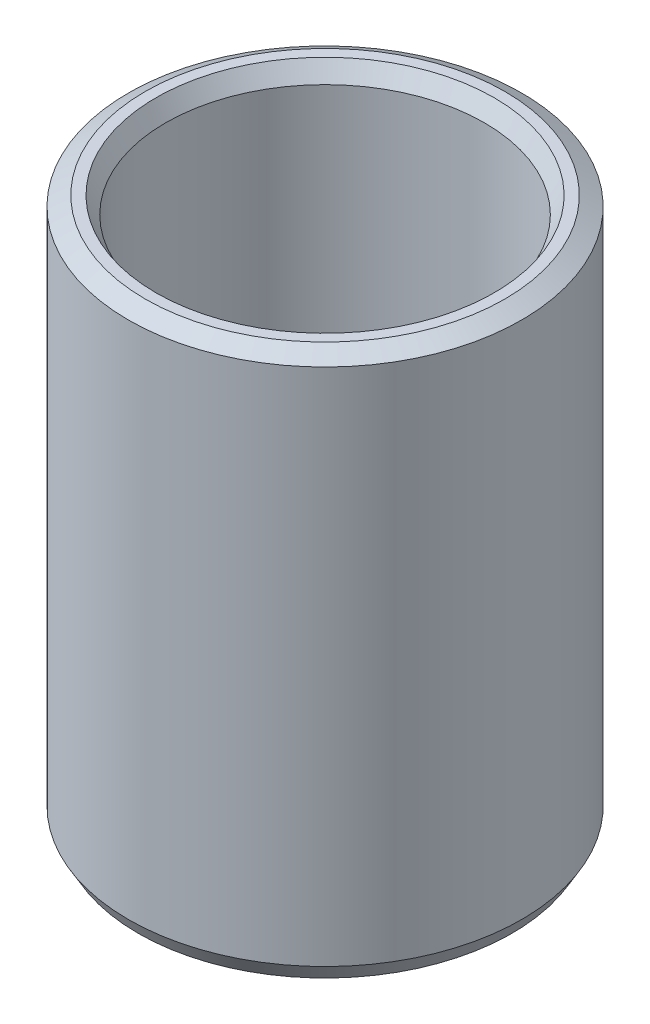
ISO-10303-21;
HEADER;
FILE_DESCRIPTION(('STEP AP214'),'2;1');
FILE_NAME('part.step','',(''),(''),'','','');
FILE_SCHEMA(('AUTOMOTIVE_DESIGN { 1 0 10303 214 1 1 1 1 }'));
ENDSEC;
DATA;
#1=APPLICATION_CONTEXT('core data for automotive mechanical design processes');
#2=APPLICATION_PROTOCOL_DEFINITION('international standard','automotive_design',2000,#1);
#3=PRODUCT_CONTEXT('',#1,'mechanical');
#4=PRODUCT('Part','Part','',(#3));
#5=PRODUCT_RELATED_PRODUCT_CATEGORY('part','',(#4));
#6=PRODUCT_DEFINITION_FORMATION('','',#4);
#7=PRODUCT_DEFINITION_CONTEXT('part definition',#1,'design');
#8=PRODUCT_DEFINITION('design','',#6,#7);
#9=PRODUCT_DEFINITION_SHAPE('','',#8);
#10=(LENGTH_UNIT() NAMED_UNIT(*) SI_UNIT(.MILLI.,.METRE.));
#11=(NAMED_UNIT(*) PLANE_ANGLE_UNIT() SI_UNIT($,.RADIAN.));
#12=(NAMED_UNIT(*) SI_UNIT($,.STERADIAN.) SOLID_ANGLE_UNIT());
#13=UNCERTAINTY_MEASURE_WITH_UNIT(LENGTH_MEASURE(1.E-05),#10,'distance_accuracy_value','');
#14=(GEOMETRIC_REPRESENTATION_CONTEXT(3) GLOBAL_UNCERTAINTY_ASSIGNED_CONTEXT((#13)) GLOBAL_UNIT_ASSIGNED_CONTEXT((#10,
#11,#12)) REPRESENTATION_CONTEXT('',''));
#15=CARTESIAN_POINT('',(0.,0.,0.));
#16=DIRECTION('',(0.,0.,1.));
#17=DIRECTION('',(1.,0.,0.));
#18=AXIS2_PLACEMENT_3D('',#15,#16,#17);
#19=CARTESIAN_POINT('',(0.,138.770867989801,0.));
#20=DIRECTION('',(0.,-1.,0.));
#21=DIRECTION('',(0.,0.,-1.));
#22=AXIS2_PLACEMENT_3D('',#19,#20,#21);
#23=CYLINDRICAL_SURFACE('',#22,50.);
#24=CARTESIAN_POINT('',(0.,4.28133755159121,0.));
#25=DIRECTION('',(0.,1.,0.));
#26=DIRECTION('',(0.,0.,1.));
#27=AXIS2_PLACEMENT_3D('',#24,#25,#26);
#28=CIRCLE('',#27,50.);
#29=CARTESIAN_POINT('',(0.,4.28133755159121,50.));
#30=VERTEX_POINT('',#29);
#31=EDGE_CURVE('E10',#30,#30,#28,.T.);
#32=ORIENTED_EDGE('',*,*,#31,.T.);
#33=EDGE_LOOP('',(#32));
#34=FACE_BOUND('',#33,.T.);
#35=CARTESIAN_POINT('',(0.,136.299036601898,0.));
#36=DIRECTION('',(0.,1.,0.));
#37=DIRECTION('',(0.,0.,1.));
#38=AXIS2_PLACEMENT_3D('',#35,#36,#37);
#39=CIRCLE('',#38,50.);
#40=CARTESIAN_POINT('',(0.,136.299036601898,50.));
#41=VERTEX_POINT('',#40);
#42=EDGE_CURVE('E50',#41,#41,#39,.F.);
#43=ORIENTED_EDGE('',*,*,#42,.T.);
#44=EDGE_LOOP('',(#43));
#45=FACE_BOUND('',#44,.T.);
#46=ADVANCED_FACE('F39',(#34,#45),#23,.T.);
#47=CARTESIAN_POINT('',(0.,138.770867989801,0.));
#48=DIRECTION('',(0.,1.,0.));
#49=DIRECTION('',(0.,0.,1.));
#50=AXIS2_PLACEMENT_3D('',#47,#48,#49);
#51=PLANE('',#50);
#52=CARTESIAN_POINT('',(0.,138.770867989801,0.));
#53=DIRECTION('',(0.,1.,0.));
#54=DIRECTION('',(0.,0.,1.));
#55=AXIS2_PLACEMENT_3D('',#52,#53,#54);
#56=CIRCLE('',#55,42.9852074359005);
#57=CARTESIAN_POINT('',(0.,138.770867989801,42.9852074359005));
#58=VERTEX_POINT('',#57);
#59=EDGE_CURVE('E58',#58,#58,#56,.F.);
#60=ORIENTED_EDGE('',*,*,#59,.T.);
#61=EDGE_LOOP('',(#60));
#62=FACE_BOUND('',#61,.T.);
#63=CARTESIAN_POINT('',(0.,138.770867989801,0.));
#64=DIRECTION('',(0.,1.,0.));
#65=DIRECTION('',(0.,0.,1.));
#66=AXIS2_PLACEMENT_3D('',#63,#64,#65);
#67=CIRCLE('',#66,45.7186624484087);
#68=CARTESIAN_POINT('',(0.,138.770867989801,45.7186624484087));
#69=VERTEX_POINT('',#68);
#70=EDGE_CURVE('E61',#69,#69,#67,.T.);
#71=ORIENTED_EDGE('',*,*,#70,.T.);
#72=EDGE_LOOP('',(#71));
#73=FACE_BOUND('',#72,.T.);
#74=ADVANCED_FACE('F88',(#62,#73),#51,.T.);
#75=CARTESIAN_POINT('',(0.,0.,0.));
#76=DIRECTION('',(0.,1.,0.));
#77=DIRECTION('',(0.,0.,1.));
#78=AXIS2_PLACEMENT_3D('',#75,#76,#77);
#79=PLANE('',#78);
#80=CARTESIAN_POINT('',(0.,0.,0.));
#81=DIRECTION('',(0.,1.,0.));
#82=DIRECTION('',(0.,0.,1.));
#83=AXIS2_PLACEMENT_3D('',#80,#81,#82);
#84=CIRCLE('',#83,44.7947135995889);
#85=CARTESIAN_POINT('',(0.,0.,44.7947135995889));
#86=VERTEX_POINT('',#85);
#87=EDGE_CURVE('E51',#86,#86,#84,.T.);
#88=ORIENTED_EDGE('',*,*,#87,.T.);
#89=EDGE_LOOP('',(#88));
#90=FACE_BOUND('',#89,.T.);
#91=CARTESIAN_POINT('',(0.,0.,0.));
#92=DIRECTION('',(0.,1.,0.));
#93=DIRECTION('',(0.,0.,1.));
#94=AXIS2_PLACEMENT_3D('',#91,#92,#93);
#95=CIRCLE('',#94,47.5281686120971);
#96=CARTESIAN_POINT('',(0.,0.,47.5281686120971));
#97=VERTEX_POINT('',#96);
#98=EDGE_CURVE('E54',#97,#97,#95,.F.);
#99=ORIENTED_EDGE('',*,*,#98,.T.);
#100=EDGE_LOOP('',(#99));
#101=FACE_BOUND('',#100,.T.);
#102=ADVANCED_FACE('F83',(#90,#101),#79,.F.);
#103=CARTESIAN_POINT('',(0.,138.770867989801,0.));
#104=DIRECTION('',(0.,-1.,0.));
#105=DIRECTION('',(0.,0.,-1.));
#106=AXIS2_PLACEMENT_3D('',#103,#104,#105);
#107=CYLINDRICAL_SURFACE('',#106,40.5133760479977);
#108=CARTESIAN_POINT('',(0.,134.48953043821,0.));
#109=DIRECTION('',(0.,1.,0.));
#110=DIRECTION('',(0.,0.,1.));
#111=AXIS2_PLACEMENT_3D('',#108,#109,#110);
#112=CIRCLE('',#111,40.5133760479977);
#113=CARTESIAN_POINT('',(0.,134.48953043821,40.5133760479977));
#114=VERTEX_POINT('',#113);
#115=EDGE_CURVE('E67',#114,#114,#112,.T.);
#116=ORIENTED_EDGE('',*,*,#115,.T.);
#117=EDGE_LOOP('',(#116));
#118=FACE_BOUND('',#117,.T.);
#119=CARTESIAN_POINT('',(0.,2.47183138790288,0.));
#120=DIRECTION('',(0.,1.,0.));
#121=DIRECTION('',(0.,0.,1.));
#122=AXIS2_PLACEMENT_3D('',#119,#120,#121);
#123=CIRCLE('',#122,40.5133760479977);
#124=CARTESIAN_POINT('',(0.,2.47183138790288,40.5133760479977));
#125=VERTEX_POINT('',#124);
#126=EDGE_CURVE('E69',#125,#125,#123,.F.);
#127=ORIENTED_EDGE('',*,*,#126,.T.);
#128=EDGE_LOOP('',(#127));
#129=FACE_BOUND('',#128,.T.);
#130=ADVANCED_FACE('F71',(#118,#129),#107,.F.);
#131=CARTESIAN_POINT('',(0.,134.48953043821,0.));
#132=DIRECTION('',(0.,1.,0.));
#133=DIRECTION('',(0.,0.,1.));
#134=AXIS2_PLACEMENT_3D('',#131,#132,#133);
#135=CONICAL_SURFACE('',#134,40.5133760479977,0.523598775598298);
#136=ORIENTED_EDGE('',*,*,#59,.F.);
#137=EDGE_LOOP('',(#136));
#138=FACE_BOUND('',#137,.T.);
#139=ORIENTED_EDGE('',*,*,#115,.F.);
#140=EDGE_LOOP('',(#139));
#141=FACE_BOUND('',#140,.T.);
#142=ADVANCED_FACE('F77',(#138,#141),#135,.F.);
#143=CARTESIAN_POINT('',(0.,0.,0.));
#144=DIRECTION('',(0.,-1.,0.));
#145=DIRECTION('',(0.,0.,-1.));
#146=AXIS2_PLACEMENT_3D('',#143,#144,#145);
#147=CONICAL_SURFACE('',#146,44.7947135995889,1.0471975511966);
#148=ORIENTED_EDGE('',*,*,#126,.F.);
#149=EDGE_LOOP('',(#148));
#150=FACE_BOUND('',#149,.T.);
#151=ORIENTED_EDGE('',*,*,#87,.F.);
#152=EDGE_LOOP('',(#151));
#153=FACE_BOUND('',#152,.T.);
#154=ADVANCED_FACE('F73',(#150,#153),#147,.F.);
#155=CARTESIAN_POINT('',(0.,4.28133755159121,0.));
#156=DIRECTION('',(0.,1.,0.));
#157=DIRECTION('',(0.,0.,1.));
#158=AXIS2_PLACEMENT_3D('',#155,#156,#157);
#159=CONICAL_SURFACE('',#158,50.,0.523598775598302);
#160=ORIENTED_EDGE('',*,*,#98,.F.);
#161=EDGE_LOOP('',(#160));
#162=FACE_BOUND('',#161,.T.);
#163=ORIENTED_EDGE('',*,*,#31,.F.);
#164=EDGE_LOOP('',(#163));
#165=FACE_BOUND('',#164,.T.);
#166=ADVANCED_FACE('F76',(#162,#165),#159,.T.);
#167=CARTESIAN_POINT('',(0.,138.770867989801,0.));
#168=DIRECTION('',(0.,-1.,0.));
#169=DIRECTION('',(0.,0.,-1.));
#170=AXIS2_PLACEMENT_3D('',#167,#168,#169);
#171=CONICAL_SURFACE('',#170,45.7186624484087,1.0471975511966);
#172=ORIENTED_EDGE('',*,*,#42,.F.);
#173=EDGE_LOOP('',(#172));
#174=FACE_BOUND('',#173,.T.);
#175=ORIENTED_EDGE('',*,*,#70,.F.);
#176=EDGE_LOOP('',(#175));
#177=FACE_BOUND('',#176,.T.);
#178=ADVANCED_FACE('F45',(#174,#177),#171,.T.);
#179=CLOSED_SHELL('',(#46,#74,#102,#130,#142,#154,#166,#178));
#180=MANIFOLD_SOLID_BREP('B2',#179);
#181=ADVANCED_BREP_SHAPE_REPRESENTATION('',(#18,#180),#14);
#182=SHAPE_DEFINITION_REPRESENTATION(#9,#181);
ENDSEC;
END-ISO-10303-21;
